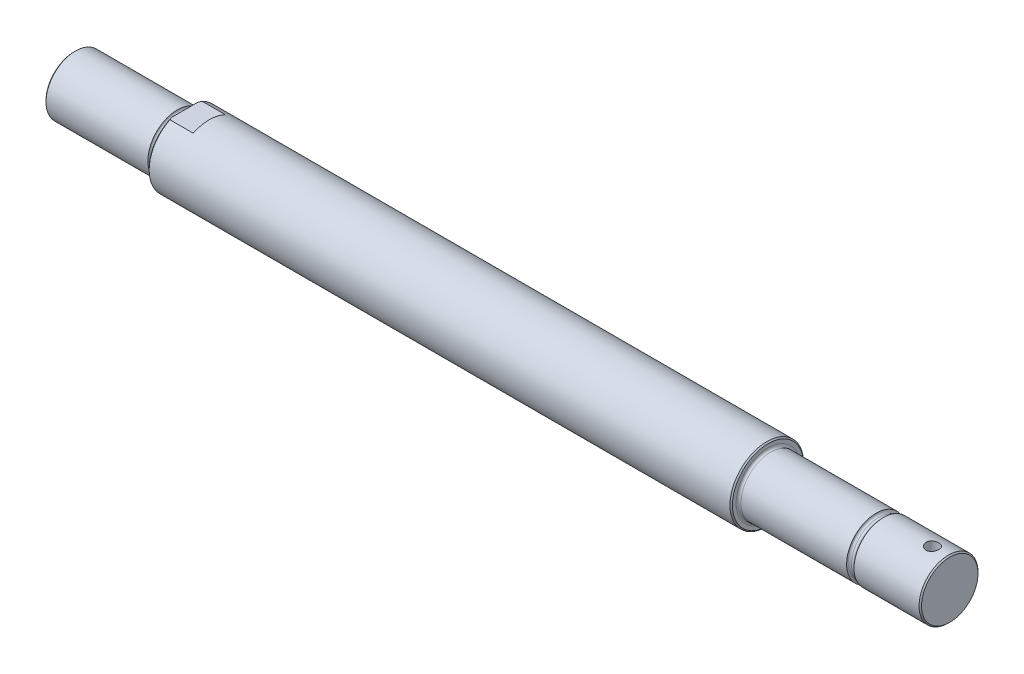
ISO-10303-21;
HEADER;
FILE_DESCRIPTION(('STEP AP214'),'2;1');
FILE_NAME('part.step','',(''),(''),'','','');
FILE_SCHEMA(('AUTOMOTIVE_DESIGN { 1 0 10303 214 1 1 1 1 }'));
ENDSEC;
DATA;
#1=APPLICATION_CONTEXT('core data for automotive mechanical design processes');
#2=APPLICATION_PROTOCOL_DEFINITION('international standard','automotive_design',2000,#1);
#3=PRODUCT_CONTEXT('',#1,'mechanical');
#4=PRODUCT('Part','Part','',(#3));
#5=PRODUCT_RELATED_PRODUCT_CATEGORY('part','',(#4));
#6=PRODUCT_DEFINITION_FORMATION('','',#4);
#7=PRODUCT_DEFINITION_CONTEXT('part definition',#1,'design');
#8=PRODUCT_DEFINITION('design','',#6,#7);
#9=PRODUCT_DEFINITION_SHAPE('','',#8);
#10=(LENGTH_UNIT() NAMED_UNIT(*) SI_UNIT(.MILLI.,.METRE.));
#11=(NAMED_UNIT(*) PLANE_ANGLE_UNIT() SI_UNIT($,.RADIAN.));
#12=(NAMED_UNIT(*) SI_UNIT($,.STERADIAN.) SOLID_ANGLE_UNIT());
#13=UNCERTAINTY_MEASURE_WITH_UNIT(LENGTH_MEASURE(1.E-05),#10,'distance_accuracy_value','');
#14=(GEOMETRIC_REPRESENTATION_CONTEXT(3) GLOBAL_UNCERTAINTY_ASSIGNED_CONTEXT((#13)) GLOBAL_UNIT_ASSIGNED_CONTEXT((#10,
#11,#12)) REPRESENTATION_CONTEXT('',''));
#15=CARTESIAN_POINT('',(0.,0.,0.));
#16=DIRECTION('',(0.,0.,1.));
#17=DIRECTION('',(1.,0.,0.));
#18=AXIS2_PLACEMENT_3D('',#15,#16,#17);
#19=CARTESIAN_POINT('',(-178.25,0.,0.));
#20=DIRECTION('',(-1.,0.,0.));
#21=DIRECTION('',(0.,0.,1.));
#22=AXIS2_PLACEMENT_3D('',#19,#20,#21);
#23=CYLINDRICAL_SURFACE('',#22,15.);
#24=CARTESIAN_POINT('',(103.75,0.,0.));
#25=DIRECTION('',(-1.,0.,0.));
#26=DIRECTION('',(0.,0.,1.));
#27=AXIS2_PLACEMENT_3D('',#24,#25,#26);
#28=CIRCLE('',#27,15.);
#29=CARTESIAN_POINT('',(103.75,0.,15.));
#30=VERTEX_POINT('',#29);
#31=EDGE_CURVE('E200',#30,#30,#28,.T.);
#32=ORIENTED_EDGE('',*,*,#31,.T.);
#33=EDGE_LOOP('',(#32));
#34=FACE_BOUND('',#33,.T.);
#35=DIRECTION('',(-1.,0.,0.));
#36=VECTOR('',#35,1.);
#37=CARTESIAN_POINT('',(-178.25,13.5,6.538348415311));
#38=LINE('',#37,#36);
#39=CARTESIAN_POINT('',(-123.25,13.5,6.538348415311));
#40=VERTEX_POINT('',#39);
#41=CARTESIAN_POINT('',(-132.75,13.5,6.538348415311));
#42=VERTEX_POINT('',#41);
#43=EDGE_CURVE('E358',#40,#42,#38,.T.);
#44=ORIENTED_EDGE('',*,*,#43,.T.);
#45=CARTESIAN_POINT('',(-132.75,0.,0.));
#46=DIRECTION('',(-1.,0.,0.));
#47=DIRECTION('',(0.,0.,1.));
#48=AXIS2_PLACEMENT_3D('',#45,#46,#47);
#49=CIRCLE('',#48,15.);
#50=CARTESIAN_POINT('',(-132.75,-13.5,6.53834841531101));
#51=VERTEX_POINT('',#50);
#52=EDGE_CURVE('E197',#42,#51,#49,.F.);
#53=ORIENTED_EDGE('',*,*,#52,.T.);
#54=DIRECTION('',(-1.,0.,0.));
#55=VECTOR('',#54,1.);
#56=CARTESIAN_POINT('',(-178.25,-13.5,6.53834841531101));
#57=LINE('',#56,#55);
#58=CARTESIAN_POINT('',(-123.25,-13.5,6.53834841531101));
#59=VERTEX_POINT('',#58);
#60=EDGE_CURVE('E139',#59,#51,#57,.T.);
#61=ORIENTED_EDGE('',*,*,#60,.F.);
#62=CARTESIAN_POINT('',(-123.25,0.,0.));
#63=DIRECTION('',(1.,0.,0.));
#64=DIRECTION('',(0.,0.,-1.));
#65=AXIS2_PLACEMENT_3D('',#62,#63,#64);
#66=CIRCLE('',#65,15.);
#67=CARTESIAN_POINT('',(-123.25,-13.5,-6.538348415311));
#68=VERTEX_POINT('',#67);
#69=EDGE_CURVE('E144',#59,#68,#66,.T.);
#70=ORIENTED_EDGE('',*,*,#69,.T.);
#71=DIRECTION('',(-1.,0.,0.));
#72=VECTOR('',#71,1.);
#73=CARTESIAN_POINT('',(-178.25,-13.5,-6.53834841531101));
#74=LINE('',#73,#72);
#75=CARTESIAN_POINT('',(-132.75,-13.5,-6.53834841531101));
#76=VERTEX_POINT('',#75);
#77=EDGE_CURVE('E125',#76,#68,#74,.F.);
#78=ORIENTED_EDGE('',*,*,#77,.F.);
#79=CARTESIAN_POINT('',(-132.75,0.,0.));
#80=DIRECTION('',(-1.,0.,0.));
#81=DIRECTION('',(0.,0.,1.));
#82=AXIS2_PLACEMENT_3D('',#79,#80,#81);
#83=CIRCLE('',#82,15.);
#84=CARTESIAN_POINT('',(-132.75,13.5,-6.53834841531101));
#85=VERTEX_POINT('',#84);
#86=EDGE_CURVE('E194',#76,#85,#83,.F.);
#87=ORIENTED_EDGE('',*,*,#86,.T.);
#88=DIRECTION('',(-1.,0.,0.));
#89=VECTOR('',#88,1.);
#90=CARTESIAN_POINT('',(-178.25,13.5,-6.53834841531101));
#91=LINE('',#90,#89);
#92=CARTESIAN_POINT('',(-123.25,13.5,-6.53834841531101));
#93=VERTEX_POINT('',#92);
#94=EDGE_CURVE('E411',#85,#93,#91,.F.);
#95=ORIENTED_EDGE('',*,*,#94,.T.);
#96=CARTESIAN_POINT('',(-123.25,0.,0.));
#97=DIRECTION('',(-1.,0.,0.));
#98=DIRECTION('',(0.,0.,1.));
#99=AXIS2_PLACEMENT_3D('',#96,#97,#98);
#100=CIRCLE('',#99,15.);
#101=EDGE_CURVE('E150',#40,#93,#100,.T.);
#102=ORIENTED_EDGE('',*,*,#101,.F.);
#103=EDGE_LOOP('',(#44,#53,#61,#70,#78,#87,#95,#102));
#104=FACE_BOUND('',#103,.T.);
#105=ADVANCED_FACE('F69',(#34,#104),#23,.T.);
#106=CARTESIAN_POINT('',(-133.25,15.,0.));
#107=DIRECTION('',(-1.,0.,0.));
#108=DIRECTION('',(0.,-1.,0.));
#109=AXIS2_PLACEMENT_3D('',#106,#107,#108);
#110=PLANE('',#109);
#111=CARTESIAN_POINT('',(-133.25,0.,0.));
#112=DIRECTION('',(-1.,0.,0.));
#113=DIRECTION('',(0.,-1.,0.));
#114=AXIS2_PLACEMENT_3D('',#111,#112,#113);
#115=CIRCLE('',#114,12.);
#116=CARTESIAN_POINT('',(-133.25,-12.,0.));
#117=VERTEX_POINT('',#116);
#118=EDGE_CURVE('E186',#117,#117,#115,.F.);
#119=ORIENTED_EDGE('',*,*,#118,.T.);
#120=EDGE_LOOP('',(#119));
#121=FACE_BOUND('',#120,.T.);
#122=DIRECTION('',(0.,0.,1.));
#123=VECTOR('',#122,1.);
#124=CARTESIAN_POINT('',(-133.25,-13.5,0.));
#125=LINE('',#124,#123);
#126=CARTESIAN_POINT('',(-133.25,-13.5,-5.29150262212928));
#127=VERTEX_POINT('',#126);
#128=CARTESIAN_POINT('',(-133.25,-13.5,5.29150262212928));
#129=VERTEX_POINT('',#128);
#130=EDGE_CURVE('E159',#127,#129,#125,.T.);
#131=ORIENTED_EDGE('',*,*,#130,.T.);
#132=CARTESIAN_POINT('',(-133.25,0.,0.));
#133=DIRECTION('',(-1.,0.,0.));
#134=DIRECTION('',(0.,-1.,0.));
#135=AXIS2_PLACEMENT_3D('',#132,#133,#134);
#136=CIRCLE('',#135,14.5);
#137=CARTESIAN_POINT('',(-133.25,13.5,5.29150262212928));
#138=VERTEX_POINT('',#137);
#139=EDGE_CURVE('E86',#129,#138,#136,.T.);
#140=ORIENTED_EDGE('',*,*,#139,.T.);
#141=DIRECTION('',(0.,0.,1.));
#142=VECTOR('',#141,1.);
#143=CARTESIAN_POINT('',(-133.25,13.5,0.));
#144=LINE('',#143,#142);
#145=CARTESIAN_POINT('',(-133.25,13.5,-5.29150262212928));
#146=VERTEX_POINT('',#145);
#147=EDGE_CURVE('E151',#146,#138,#144,.T.);
#148=ORIENTED_EDGE('',*,*,#147,.F.);
#149=CARTESIAN_POINT('',(-133.25,0.,0.));
#150=DIRECTION('',(-1.,0.,0.));
#151=DIRECTION('',(0.,-1.,0.));
#152=AXIS2_PLACEMENT_3D('',#149,#150,#151);
#153=CIRCLE('',#152,14.5);
#154=EDGE_CURVE('E400',#146,#127,#153,.T.);
#155=ORIENTED_EDGE('',*,*,#154,.T.);
#156=EDGE_LOOP('',(#131,#140,#148,#155));
#157=FACE_BOUND('',#156,.T.);
#158=ADVANCED_FACE('F268',(#121,#157),#110,.T.);
#159=CARTESIAN_POINT('',(178.25,0.,0.));
#160=DIRECTION('',(1.,0.,0.));
#161=DIRECTION('',(0.,1.,0.));
#162=AXIS2_PLACEMENT_3D('',#159,#160,#161);
#163=CYLINDRICAL_SURFACE('',#162,12.);
#164=CARTESIAN_POINT('',(177.75,0.,0.));
#165=DIRECTION('',(-1.,0.,0.));
#166=DIRECTION('',(0.,-1.,0.));
#167=AXIS2_PLACEMENT_3D('',#164,#165,#166);
#168=CIRCLE('',#167,12.);
#169=CARTESIAN_POINT('',(177.75,-12.,0.));
#170=VERTEX_POINT('',#169);
#171=EDGE_CURVE('E208',#170,#170,#168,.T.);
#172=ORIENTED_EDGE('',*,*,#171,.T.);
#173=EDGE_LOOP('',(#172));
#174=FACE_BOUND('',#173,.T.);
#175=CARTESIAN_POINT('',(168.65,12.,0.));
#176=CARTESIAN_POINT('',(168.650004972303,11.9999973354446,0.144236726439558));
#177=CARTESIAN_POINT('',(168.662042967354,11.9973730147826,0.288533845639436));
#178=CARTESIAN_POINT('',(168.709828238634,11.9871575196756,0.573031652658619));
#179=CARTESIAN_POINT('',(168.745592673061,11.9795627508158,0.713229299208327));
#180=CARTESIAN_POINT('',(168.839659865051,11.9602522565868,0.985375249675089));
#181=CARTESIAN_POINT('',(168.897939301033,11.9485407965133,1.11733192602805));
#182=CARTESIAN_POINT('',(169.035308673135,11.9222619563313,1.36958904863448));
#183=CARTESIAN_POINT('',(169.114397991646,11.9076946609835,1.48988984067429));
#184=CARTESIAN_POINT('',(169.292461597268,11.8770440902161,1.71732166523923));
#185=CARTESIAN_POINT('',(169.391700998679,11.8609423068128,1.82424265549683));
#186=CARTESIAN_POINT('',(169.606678488386,11.8291684195956,2.02005881340805));
#187=CARTESIAN_POINT('',(169.722418024412,11.8134963536293,2.1089523976706));
#188=CARTESIAN_POINT('',(169.968658566674,11.7841740733055,2.26711337737444));
#189=CARTESIAN_POINT('',(170.099305825496,11.7705475862121,2.33615786385217));
#190=CARTESIAN_POINT('',(170.37069243936,11.7471246428021,2.45123108596793));
#191=CARTESIAN_POINT('',(170.51143060977,11.7373277377766,2.49726251820138));
#192=CARTESIAN_POINT('',(170.796727639718,11.7228615532269,2.56431019661689));
#193=CARTESIAN_POINT('',(170.941195252538,11.7181162066326,2.58569794861031));
#194=CARTESIAN_POINT('',(171.231740095497,11.714061911669,2.60400615804867));
#195=CARTESIAN_POINT('',(171.377817129506,11.71475230804,2.60092956458315));
#196=CARTESIAN_POINT('',(171.664677398804,11.7214225988847,2.57069554242108));
#197=CARTESIAN_POINT('',(171.805508585277,11.7273078350462,2.54396903156786));
#198=CARTESIAN_POINT('',(172.080639595153,11.7435550978599,2.46787625956814));
#199=CARTESIAN_POINT('',(172.214939057839,11.7539173714466,2.41850874963034));
#200=CARTESIAN_POINT('',(172.474409227574,11.7780448194994,2.29813787328689));
#201=CARTESIAN_POINT('',(172.599500280537,11.7918359866955,2.22696823220314));
#202=CARTESIAN_POINT('',(172.836124048607,11.8212512787303,2.065130298781));
#203=CARTESIAN_POINT('',(172.947654945252,11.8368756488568,1.9744593957635));
#204=CARTESIAN_POINT('',(173.156474019979,11.8686034657252,1.77390871521164));
#205=CARTESIAN_POINT('',(173.253409997498,11.8847100454316,1.66366235662348));
#206=CARTESIAN_POINT('',(173.427473894395,11.9152855453676,1.42829655036696));
#207=CARTESIAN_POINT('',(173.504601467898,11.9297544369988,1.30317684305031));
#208=CARTESIAN_POINT('',(173.636943705019,11.9554698973281,1.04119055177431));
#209=CARTESIAN_POINT('',(173.692112890846,11.9667097651791,0.904300295205736));
#210=CARTESIAN_POINT('',(173.77856861265,11.9846508353724,0.622894974848423));
#211=CARTESIAN_POINT('',(173.80985855501,11.9913526850491,0.478381001731169));
#212=CARTESIAN_POINT('',(173.847156868924,11.999370689196,0.188852168823128));
#213=CARTESIAN_POINT('',(173.853646449489,12.0007893411299,0.0439020574477344));
#214=CARTESIAN_POINT('',(173.842463167102,11.9983680429883,-0.245011114222885));
#215=CARTESIAN_POINT('',(173.824791910674,11.9945284425491,-0.388974239506001));
#216=CARTESIAN_POINT('',(173.766187693156,11.9820866849589,-0.670237247334904));
#217=CARTESIAN_POINT('',(173.725506502814,11.9735361004107,-0.80759207245683));
#218=CARTESIAN_POINT('',(173.622316167325,11.9526291720799,-1.0735286997633));
#219=CARTESIAN_POINT('',(173.559805186749,11.9402725082958,-1.20210976317082));
#220=CARTESIAN_POINT('',(173.413722739961,11.9128709234998,-1.44884325605772));
#221=CARTESIAN_POINT('',(173.329867778462,11.8977906795577,-1.56682382807616));
#222=CARTESIAN_POINT('',(173.143851729171,11.8666879962894,-1.78721154382001));
#223=CARTESIAN_POINT('',(173.041688311542,11.8506654372236,-1.88961670243109));
#224=CARTESIAN_POINT('',(172.819749150625,11.8191309043505,-2.07784405093427));
#225=CARTESIAN_POINT('',(172.699688642265,11.8036333783503,-2.16333333925308));
#226=CARTESIAN_POINT('',(172.446631314418,11.775234476741,-2.31293638979139));
#227=CARTESIAN_POINT('',(172.313635051273,11.7623329895541,-2.37705107076864));
#228=CARTESIAN_POINT('',(172.039191143534,11.7407086018304,-2.48165614660999));
#229=CARTESIAN_POINT('',(171.897795682338,11.7319624281802,-2.52227840324693));
#230=CARTESIAN_POINT('',(171.609972351161,11.7195960803086,-2.57913351826821));
#231=CARTESIAN_POINT('',(171.463545272258,11.7159751040391,-2.59537019280476));
#232=CARTESIAN_POINT('',(171.173170103694,11.7143189953347,-2.60283320848537));
#233=CARTESIAN_POINT('',(171.029235994595,11.7161660225572,-2.59458716285149));
#234=CARTESIAN_POINT('',(170.744860265962,11.7249716694698,-2.55449661594729));
#235=CARTESIAN_POINT('',(170.60441860688,11.7319302312494,-2.52265238202999));
#236=CARTESIAN_POINT('',(170.331424000623,11.7501179820486,-2.43652213110984));
#237=CARTESIAN_POINT('',(170.198846241061,11.7613328104136,-2.38231152530464));
#238=CARTESIAN_POINT('',(169.944588721284,11.786775368259,-2.25305267013939));
#239=CARTESIAN_POINT('',(169.822910073498,11.8010034047887,-2.1780022969411));
#240=CARTESIAN_POINT('',(169.591300835105,11.8312222292587,-2.00743837935343));
#241=CARTESIAN_POINT('',(169.481651360132,11.8472423996664,-1.91154824147323));
#242=CARTESIAN_POINT('',(169.279826560398,11.8790414924123,-1.70279162388224));
#243=CARTESIAN_POINT('',(169.187655276868,11.8948203581836,-1.58992122886305));
#244=CARTESIAN_POINT('',(169.022286252632,11.9245960952928,-1.34868418142398));
#245=CARTESIAN_POINT('',(168.949343857588,11.9385678399551,-1.22013921864495));
#246=CARTESIAN_POINT('',(168.826215648375,11.9629036221577,-0.952339105556218));
#247=CARTESIAN_POINT('',(168.776010585299,11.9732707095849,-0.813093131747957));
#248=CARTESIAN_POINT('',(168.70881884729,11.9873604762337,-0.561406270703277));
#249=CARTESIAN_POINT('',(168.686803544831,11.9920711259945,-0.450335585529253));
#250=CARTESIAN_POINT('',(168.657392484021,11.9983918663936,-0.226188923413988));
#251=CARTESIAN_POINT('',(168.64999610063,12.0000020895922,-0.11311303241497));
#252=CARTESIAN_POINT('',(168.65,12.,0.));
#253=B_SPLINE_CURVE_WITH_KNOTS('',3,(#175,#176,#177,#178,#179,#180,#181,#182,#183,#184,#185,
#186,#187,#188,#189,#190,#191,#192,#193,#194,#195,#196,#197,#198,#199,#200,#201,#202,#203,#204,
#205,#206,#207,#208,#209,#210,#211,#212,#213,#214,#215,#216,#217,#218,#219,#220,#221,#222,#223,
#224,#225,#226,#227,#228,#229,#230,#231,#232,#233,#234,#235,#236,#237,#238,#239,#240,#241,#242,
#243,#244,#245,#246,#247,#248,#249,#250,#251,#252),.UNSPECIFIED.,.T.,.F.,(4,2,2,2,2,2,2,2,2,2,2,
2,2,2,2,2,2,2,2,2,2,2,2,2,2,2,2,2,2,2,2,2,2,2,2,2,2,2,4),(0.,0.432296167596458,
0.864905299162181,1.29706752004108,1.72921691636087,2.16747088004792,2.60576331999454,
3.04880106599835,3.49178688609446,3.92800348668547,4.36416750371916,4.7925442862594,
5.22094469927376,5.65269728196235,6.08450770038595,6.52547542392672,6.96645084669751,
7.40833487520641,7.85015585701494,8.28335919264328,8.71653372472676,9.14505776341681,
9.57361784070126,10.0081977504593,10.4428330018757,10.885318030012,11.3277840360924,
11.767741776118,12.2076306590336,12.6381090344705,13.0685825329256,13.4976163421279,
13.9266938914079,14.364287920262,14.8019830046558,15.2452268636413,15.6880947778048,
16.0271236952943,16.366138117108),.UNSPECIFIED.);
#254=CARTESIAN_POINT('',(168.65,12.,0.));
#255=VERTEX_POINT('',#254);
#256=EDGE_CURVE('E337',#255,#255,#253,.T.);
#257=ORIENTED_EDGE('',*,*,#256,.F.);
#258=EDGE_LOOP('',(#257));
#259=FACE_BOUND('',#258,.T.);
#260=CARTESIAN_POINT('',(171.25,-11.714947716486,2.59999999999999));
#261=CARTESIAN_POINT('',(171.105808071027,-11.7149506300318,2.59999499534854));
#262=CARTESIAN_POINT('',(170.961555668416,-11.7176388577269,2.58796422285042));
#263=CARTESIAN_POINT('',(170.677150686029,-11.7280820029083,2.54021023721584));
#264=CARTESIAN_POINT('',(170.537001184745,-11.7358406279201,2.50446968696193));
#265=CARTESIAN_POINT('',(170.264957242693,-11.7555055486852,2.41047231141574));
#266=CARTESIAN_POINT('',(170.133054021162,-11.7674073408381,2.35223992712881));
#267=CARTESIAN_POINT('',(169.880887156447,-11.7940121510493,2.21498149637594));
#268=CARTESIAN_POINT('',(169.760623227204,-11.8087151002375,2.13595596111855));
#269=CARTESIAN_POINT('',(169.53315267133,-11.8395378925012,1.9579579997251));
#270=CARTESIAN_POINT('',(169.426167097344,-11.8556755712714,1.85870612184275));
#271=CARTESIAN_POINT('',(169.230225467065,-11.8873932725662,1.6436761932946));
#272=CARTESIAN_POINT('',(169.14127079599,-11.90297325217,1.52789687407801));
#273=CARTESIAN_POINT('',(168.983043558656,-11.9320141366661,1.28161861627876));
#274=CARTESIAN_POINT('',(168.91398331399,-11.9454515442086,1.15098025766275));
#275=CARTESIAN_POINT('',(168.798878539532,-11.9684919123295,0.879612849767239));
#276=CARTESIAN_POINT('',(168.75283147631,-11.978095294957,0.738884913160424));
#277=CARTESIAN_POINT('',(168.685754606161,-11.9922595380826,0.453631049271671));
#278=CARTESIAN_POINT('',(168.664350773055,-11.9968957117097,0.309196876165756));
#279=CARTESIAN_POINT('',(168.645998797252,-12.0008640083932,0.0187183852466908));
#280=CARTESIAN_POINT('',(168.649047907106,-12.0001967273276,-0.127325749835409));
#281=CARTESIAN_POINT('',(168.679236113251,-11.9936909484855,-0.414301026380135));
#282=CARTESIAN_POINT('',(168.705972087125,-11.9879389895303,-0.555276824288543));
#283=CARTESIAN_POINT('',(168.782133037528,-11.972008636555,-0.830692063804933));
#284=CARTESIAN_POINT('',(168.83155902721,-11.9618300448781,-0.965131213242441));
#285=CARTESIAN_POINT('',(168.952055481834,-11.9380505435059,-1.2247795133764));
#286=CARTESIAN_POINT('',(169.023279335575,-11.924425503437,-1.34991517963827));
#287=CARTESIAN_POINT('',(169.185235455801,-11.8952479893853,-1.58660567091395));
#288=CARTESIAN_POINT('',(169.275970333295,-11.8796952575525,-1.69815867513289));
#289=CARTESIAN_POINT('',(169.476569499688,-11.8479985747636,-1.9069142433668));
#290=CARTESIAN_POINT('',(169.586786607313,-11.831849036322,-2.00377721909878));
#291=CARTESIAN_POINT('',(169.822066863526,-11.8010768696216,-2.17770734206603));
#292=CARTESIAN_POINT('',(169.947130399308,-11.7864542812042,-2.25477397284819));
#293=CARTESIAN_POINT('',(170.209095441474,-11.7603772959716,-2.38707079423465));
#294=CARTESIAN_POINT('',(170.3460298026,-11.7489320859654,-2.44223785994898));
#295=CARTESIAN_POINT('',(170.6275318274,-11.7306337989501,-2.52867613095888));
#296=CARTESIAN_POINT('',(170.77209830153,-11.7237800085877,-2.55995104840175));
#297=CARTESIAN_POINT('',(171.06166074473,-11.7155857757038,-2.59719269835716));
#298=CARTESIAN_POINT('',(171.206590207231,-11.714137731798,-2.60365343331652));
#299=CARTESIAN_POINT('',(171.49545541092,-11.7166288478047,-2.59241985028292));
#300=CARTESIAN_POINT('',(171.639391218338,-11.7205676451107,-2.57472715813842));
#301=CARTESIAN_POINT('',(171.92047001659,-11.733287126794,-2.51611725451018));
#302=CARTESIAN_POINT('',(172.057672344591,-11.7420112458403,-2.47547120265603));
#303=CARTESIAN_POINT('',(172.32331934446,-11.7632675177894,-2.37240155419931));
#304=CARTESIAN_POINT('',(172.451763189693,-11.7758000295249,-2.30997590540734));
#305=CARTESIAN_POINT('',(172.698387696241,-11.8034980027526,-2.16402732754586));
#306=CARTESIAN_POINT('',(172.816383709872,-11.818700425937,-2.08019953748662));
#307=CARTESIAN_POINT('',(173.036815015652,-11.8499273689652,-1.89422599437251));
#308=CARTESIAN_POINT('',(173.139248410603,-11.8659519887228,-1.79207801125626));
#309=CARTESIAN_POINT('',(173.327559160709,-11.8973718264988,-1.57013026191641));
#310=CARTESIAN_POINT('',(173.413100033166,-11.9127502076758,-1.45004222260283));
#311=CARTESIAN_POINT('',(173.562793541039,-11.940837013015,-1.19691389957492));
#312=CARTESIAN_POINT('',(173.626947165099,-11.9535455605824,-1.06387421492847));
#313=CARTESIAN_POINT('',(173.731573988276,-11.974789690183,-0.789439876043639));
#314=CARTESIAN_POINT('',(173.77219556423,-11.9833513621378,-0.648103900948666));
#315=CARTESIAN_POINT('',(173.829069385307,-11.995449777427,-0.36040783253454));
#316=CARTESIAN_POINT('',(173.845325103092,-11.998987236817,-0.21404845820063));
#317=CARTESIAN_POINT('',(173.852852086312,-12.0006178834246,0.0763433045858421));
#318=CARTESIAN_POINT('',(173.844626123566,-11.9988206298237,0.220362276509854));
#319=CARTESIAN_POINT('',(173.804546194341,-11.9902180245313,0.504913147396077));
#320=CARTESIAN_POINT('',(173.772692637191,-11.9834127595998,0.645445106724525));
#321=CARTESIAN_POINT('',(173.68650073582,-11.9655663169557,0.918652480291165));
#322=CARTESIAN_POINT('',(173.632232467616,-11.9545383486205,1.05135091995898));
#323=CARTESIAN_POINT('',(173.502820428586,-11.9294252118726,1.30582634329755));
#324=CARTESIAN_POINT('',(173.427674672628,-11.9153397527671,1.42760228694812));
#325=CARTESIAN_POINT('',(173.25699491074,-11.8853211156753,1.65923226441778));
#326=CARTESIAN_POINT('',(173.161106630302,-11.8693583641116,1.76882143805988));
#327=CARTESIAN_POINT('',(172.952379890983,-11.8375453740579,1.97052545166515));
#328=CARTESIAN_POINT('',(172.839537361588,-11.8216951635473,2.06263608318612));
#329=CARTESIAN_POINT('',(172.598332728296,-11.7916713632252,2.22792599963228));
#330=CARTESIAN_POINT('',(172.469787123146,-11.7775223839328,2.30084222447144));
#331=CARTESIAN_POINT('',(172.20198849329,-11.7528114262808,2.42392133822827));
#332=CARTESIAN_POINT('',(172.062744724967,-11.7422463889105,2.4741036436211));
#333=CARTESIAN_POINT('',(171.81111539032,-11.7278707536719,2.54124250613354));
#334=CARTESIAN_POINT('',(171.700103257723,-11.7230565314123,2.56323463936517));
#335=CARTESIAN_POINT('',(171.476073079218,-11.716593944907,2.59261500559942));
#336=CARTESIAN_POINT('',(171.363055127697,-11.7149454320912,2.60000392394714));
#337=CARTESIAN_POINT('',(171.25,-11.714947716486,2.59999999999999));
#338=B_SPLINE_CURVE_WITH_KNOTS('',3,(#260,#261,#262,#263,#264,#265,#266,#267,#268,#269,#270,
#271,#272,#273,#274,#275,#276,#277,#278,#279,#280,#281,#282,#283,#284,#285,#286,#287,#288,#289,
#290,#291,#292,#293,#294,#295,#296,#297,#298,#299,#300,#301,#302,#303,#304,#305,#306,#307,#308,
#309,#310,#311,#312,#313,#314,#315,#316,#317,#318,#319,#320,#321,#322,#323,#324,#325,#326,#327,
#328,#329,#330,#331,#332,#333,#334,#335,#336,#337),.UNSPECIFIED.,.T.,.F.,(4,2,2,2,2,2,2,2,2,2,2,
2,2,2,2,2,2,2,2,2,2,2,2,2,2,2,2,2,2,2,2,2,2,2,2,2,2,2,4),(0.,0.432161493823311,
0.864639342588248,1.29664855063133,1.72864713853472,2.16707728816394,2.60554110726698,
3.04852433811463,3.49145879195404,3.92757804331551,4.36364829451038,4.79243672630817,
5.22124430620132,5.65314157085297,6.08509666897972,6.52587314294714,6.9666611148584,
7.40871057726847,7.85069134402905,8.28382608870744,8.71693167906616,9.14502470737239,
9.57315808377848,10.0077679909162,10.4424308377473,10.8850309556059,11.3276106110721,
11.7673684074966,12.2070635229448,12.6377914980314,13.0685120112597,13.4978960173905,
13.9273208653775,14.3647586634598,14.8023016535098,15.2455611281641,15.6884413088886,
16.0272977646138,16.3661383170514),.UNSPECIFIED.);
#339=CARTESIAN_POINT('',(171.25,-11.714947716486,2.59999999999999));
#340=VERTEX_POINT('',#339);
#341=EDGE_CURVE('E341',#340,#340,#338,.T.);
#342=ORIENTED_EDGE('',*,*,#341,.F.);
#343=EDGE_LOOP('',(#342));
#344=FACE_BOUND('',#343,.T.);
#345=CARTESIAN_POINT('',(151.25,0.,0.));
#346=DIRECTION('',(-1.,0.,0.));
#347=DIRECTION('',(0.,-1.,0.));
#348=AXIS2_PLACEMENT_3D('',#345,#346,#347);
#349=CIRCLE('',#348,12.);
#350=CARTESIAN_POINT('',(151.25,-12.,0.));
#351=VERTEX_POINT('',#350);
#352=EDGE_CURVE('E344',#351,#351,#349,.F.);
#353=ORIENTED_EDGE('',*,*,#352,.T.);
#354=EDGE_LOOP('',(#353));
#355=FACE_BOUND('',#354,.T.);
#356=ADVANCED_FACE('F274',(#174,#259,#344,#355),#163,.T.);
#357=CARTESIAN_POINT('',(105.25,0.,0.));
#358=DIRECTION('',(-1.,0.,0.));
#359=DIRECTION('',(0.,-1.,0.));
#360=AXIS2_PLACEMENT_3D('',#357,#358,#359);
#361=CIRCLE('',#360,12.);
#362=CARTESIAN_POINT('',(105.25,-12.,0.));
#363=VERTEX_POINT('',#362);
#364=EDGE_CURVE('E170',#363,#363,#361,.F.);
#365=ORIENTED_EDGE('',*,*,#364,.T.);
#366=EDGE_LOOP('',(#365));
#367=FACE_BOUND('',#366,.T.);
#368=CARTESIAN_POINT('',(148.25,0.,0.));
#369=DIRECTION('',(-1.,0.,0.));
#370=DIRECTION('',(0.,-1.,0.));
#371=AXIS2_PLACEMENT_3D('',#368,#369,#370);
#372=CIRCLE('',#371,12.);
#373=CARTESIAN_POINT('',(148.25,-12.,0.));
#374=VERTEX_POINT('',#373);
#375=EDGE_CURVE('E347',#374,#374,#372,.F.);
#376=ORIENTED_EDGE('',*,*,#375,.F.);
#377=EDGE_LOOP('',(#376));
#378=FACE_BOUND('',#377,.T.);
#379=ADVANCED_FACE('F332',(#367,#378),#163,.T.);
#380=CARTESIAN_POINT('',(104.25,15.,0.));
#381=DIRECTION('',(-1.,0.,0.));
#382=DIRECTION('',(0.,-1.,0.));
#383=AXIS2_PLACEMENT_3D('',#380,#381,#382);
#384=PLANE('',#383);
#385=CARTESIAN_POINT('',(104.25,0.,0.));
#386=DIRECTION('',(-1.,0.,0.));
#387=DIRECTION('',(0.,-1.,0.));
#388=AXIS2_PLACEMENT_3D('',#385,#386,#387);
#389=CIRCLE('',#388,14.5000000000001);
#390=CARTESIAN_POINT('',(104.25,-14.5,0.));
#391=VERTEX_POINT('',#390);
#392=EDGE_CURVE('E190',#391,#391,#389,.F.);
#393=ORIENTED_EDGE('',*,*,#392,.T.);
#394=EDGE_LOOP('',(#393));
#395=FACE_BOUND('',#394,.T.);
#396=CARTESIAN_POINT('',(104.25,0.,0.));
#397=DIRECTION('',(-1.,0.,0.));
#398=DIRECTION('',(0.,-1.,0.));
#399=AXIS2_PLACEMENT_3D('',#396,#397,#398);
#400=CIRCLE('',#399,13.);
#401=CARTESIAN_POINT('',(104.25,-13.,0.));
#402=VERTEX_POINT('',#401);
#403=EDGE_CURVE('E174',#402,#402,#400,.T.);
#404=ORIENTED_EDGE('',*,*,#403,.T.);
#405=EDGE_LOOP('',(#404));
#406=FACE_BOUND('',#405,.T.);
#407=ADVANCED_FACE('F376',(#395,#406),#384,.F.);
#408=CARTESIAN_POINT('',(178.25,0.,0.));
#409=DIRECTION('',(1.,0.,0.));
#410=DIRECTION('',(0.,1.,0.));
#411=AXIS2_PLACEMENT_3D('',#408,#409,#410);
#412=CYLINDRICAL_SURFACE('',#411,11.);
#413=CARTESIAN_POINT('',(150.25,0.,0.));
#414=DIRECTION('',(-1.,0.,0.));
#415=DIRECTION('',(0.,-1.,0.));
#416=AXIS2_PLACEMENT_3D('',#413,#414,#415);
#417=CIRCLE('',#416,11.);
#418=CARTESIAN_POINT('',(150.25,-11.,0.));
#419=VERTEX_POINT('',#418);
#420=EDGE_CURVE('E166',#419,#419,#417,.T.);
#421=ORIENTED_EDGE('',*,*,#420,.T.);
#422=EDGE_LOOP('',(#421));
#423=FACE_BOUND('',#422,.T.);
#424=CARTESIAN_POINT('',(149.25,0.,0.));
#425=DIRECTION('',(-1.,0.,0.));
#426=DIRECTION('',(0.,-1.,0.));
#427=AXIS2_PLACEMENT_3D('',#424,#425,#426);
#428=CIRCLE('',#427,11.);
#429=CARTESIAN_POINT('',(149.25,-11.,0.));
#430=VERTEX_POINT('',#429);
#431=EDGE_CURVE('E157',#430,#430,#428,.F.);
#432=ORIENTED_EDGE('',*,*,#431,.T.);
#433=EDGE_LOOP('',(#432));
#434=FACE_BOUND('',#433,.T.);
#435=ADVANCED_FACE('F277',(#423,#434),#412,.T.);
#436=CARTESIAN_POINT('',(178.25,0.,0.));
#437=DIRECTION('',(1.,0.,0.));
#438=DIRECTION('',(0.,1.,0.));
#439=AXIS2_PLACEMENT_3D('',#436,#437,#438);
#440=CYLINDRICAL_SURFACE('',#439,12.);
#441=CARTESIAN_POINT('',(-177.75,0.,0.));
#442=DIRECTION('',(1.,0.,0.));
#443=DIRECTION('',(0.,1.,0.));
#444=AXIS2_PLACEMENT_3D('',#441,#442,#443);
#445=CIRCLE('',#444,12.);
#446=CARTESIAN_POINT('',(-177.75,12.,0.));
#447=VERTEX_POINT('',#446);
#448=EDGE_CURVE('E79',#447,#447,#445,.T.);
#449=ORIENTED_EDGE('',*,*,#448,.T.);
#450=EDGE_LOOP('',(#449));
#451=FACE_BOUND('',#450,.T.);
#452=CARTESIAN_POINT('',(-136.25,0.,0.));
#453=DIRECTION('',(-1.,0.,0.));
#454=DIRECTION('',(0.,-1.,0.));
#455=AXIS2_PLACEMENT_3D('',#452,#453,#454);
#456=CIRCLE('',#455,12.);
#457=CARTESIAN_POINT('',(-136.25,-12.,0.));
#458=VERTEX_POINT('',#457);
#459=EDGE_CURVE('E348',#458,#458,#456,.T.);
#460=ORIENTED_EDGE('',*,*,#459,.T.);
#461=EDGE_LOOP('',(#460));
#462=FACE_BOUND('',#461,.T.);
#463=ADVANCED_FACE('F286',(#451,#462),#440,.T.);
#464=CARTESIAN_POINT('',(178.25,0.,0.));
#465=DIRECTION('',(1.,0.,0.));
#466=DIRECTION('',(0.,1.,0.));
#467=AXIS2_PLACEMENT_3D('',#464,#465,#466);
#468=CYLINDRICAL_SURFACE('',#467,11.);
#469=CARTESIAN_POINT('',(-135.25,0.,0.));
#470=DIRECTION('',(-1.,0.,0.));
#471=DIRECTION('',(0.,-1.,0.));
#472=AXIS2_PLACEMENT_3D('',#469,#470,#471);
#473=CIRCLE('',#472,11.);
#474=CARTESIAN_POINT('',(-135.25,-11.,0.));
#475=VERTEX_POINT('',#474);
#476=EDGE_CURVE('E182',#475,#475,#473,.F.);
#477=ORIENTED_EDGE('',*,*,#476,.T.);
#478=EDGE_LOOP('',(#477));
#479=FACE_BOUND('',#478,.T.);
#480=CARTESIAN_POINT('',(-134.25,0.,0.));
#481=DIRECTION('',(-1.,0.,0.));
#482=DIRECTION('',(0.,-1.,0.));
#483=AXIS2_PLACEMENT_3D('',#480,#481,#482);
#484=CIRCLE('',#483,11.);
#485=CARTESIAN_POINT('',(-134.25,-11.,0.));
#486=VERTEX_POINT('',#485);
#487=EDGE_CURVE('E178',#486,#486,#484,.T.);
#488=ORIENTED_EDGE('',*,*,#487,.T.);
#489=EDGE_LOOP('',(#488));
#490=FACE_BOUND('',#489,.T.);
#491=ADVANCED_FACE('F284',(#479,#490),#468,.T.);
#492=CARTESIAN_POINT('',(178.25,15.,0.));
#493=DIRECTION('',(-1.,0.,0.));
#494=DIRECTION('',(0.,0.,1.));
#495=AXIS2_PLACEMENT_3D('',#492,#493,#494);
#496=PLANE('',#495);
#497=CARTESIAN_POINT('',(178.25,0.,0.));
#498=DIRECTION('',(-1.,0.,0.));
#499=DIRECTION('',(0.,0.,1.));
#500=AXIS2_PLACEMENT_3D('',#497,#498,#499);
#501=CIRCLE('',#500,11.5);
#502=CARTESIAN_POINT('',(178.25,0.,11.5));
#503=VERTEX_POINT('',#502);
#504=EDGE_CURVE('E204',#503,#503,#501,.F.);
#505=ORIENTED_EDGE('',*,*,#504,.T.);
#506=EDGE_LOOP('',(#505));
#507=FACE_BOUND('',#506,.T.);
#508=ADVANCED_FACE('F280',(#507),#496,.F.);
#509=CARTESIAN_POINT('',(-178.25,15.,0.));
#510=DIRECTION('',(1.,0.,0.));
#511=DIRECTION('',(0.,0.,-1.));
#512=AXIS2_PLACEMENT_3D('',#509,#510,#511);
#513=PLANE('',#512);
#514=CARTESIAN_POINT('',(-178.25,0.,0.));
#515=DIRECTION('',(1.,0.,0.));
#516=DIRECTION('',(0.,0.,-1.));
#517=AXIS2_PLACEMENT_3D('',#514,#515,#516);
#518=CIRCLE('',#517,11.4999999999999);
#519=CARTESIAN_POINT('',(-178.25,0.,-11.4999999999999));
#520=VERTEX_POINT('',#519);
#521=EDGE_CURVE('E13',#520,#520,#518,.F.);
#522=ORIENTED_EDGE('',*,*,#521,.T.);
#523=EDGE_LOOP('',(#522));
#524=FACE_BOUND('',#523,.T.);
#525=ADVANCED_FACE('F283',(#524),#513,.F.);
#526=CARTESIAN_POINT('',(171.25,-15.,0.));
#527=DIRECTION('',(0.,0.999999999999999,0.));
#528=DIRECTION('',(0.,0.,1.));
#529=AXIS2_PLACEMENT_3D('',#526,#527,#528);
#530=CYLINDRICAL_SURFACE('',#529,2.59999999999999);
#531=ORIENTED_EDGE('',*,*,#256,.T.);
#532=EDGE_LOOP('',(#531));
#533=FACE_BOUND('',#532,.T.);
#534=ORIENTED_EDGE('',*,*,#341,.T.);
#535=EDGE_LOOP('',(#534));
#536=FACE_BOUND('',#535,.T.);
#537=ADVANCED_FACE('F289',(#533,#536),#530,.F.);
#538=CARTESIAN_POINT('',(-123.25,-15.,-15.));
#539=DIRECTION('',(1.,0.,0.));
#540=DIRECTION('',(0.,0.,-1.));
#541=AXIS2_PLACEMENT_3D('',#538,#539,#540);
#542=PLANE('',#541);
#543=DIRECTION('',(0.,0.,1.));
#544=VECTOR('',#543,1.);
#545=CARTESIAN_POINT('',(-123.25,-13.5,-15.));
#546=LINE('',#545,#544);
#547=EDGE_CURVE('E129',#68,#59,#546,.T.);
#548=ORIENTED_EDGE('',*,*,#547,.F.);
#549=ORIENTED_EDGE('',*,*,#69,.F.);
#550=EDGE_LOOP('',(#548,#549));
#551=FACE_BOUND('',#550,.T.);
#552=ADVANCED_FACE('F143',(#551),#542,.F.);
#553=CARTESIAN_POINT('',(-133.25,-13.5,-15.));
#554=DIRECTION('',(0.,-1.,0.));
#555=DIRECTION('',(0.,0.,-1.));
#556=AXIS2_PLACEMENT_3D('',#553,#554,#555);
#557=PLANE('',#556);
#558=ORIENTED_EDGE('',*,*,#60,.T.);
#559=CARTESIAN_POINT('',(-132.75,-13.5,6.53834841531101));
#560=CARTESIAN_POINT('',(-132.794743033035,-13.5,6.4357000597834));
#561=CARTESIAN_POINT('',(-132.838769882802,-13.5,6.33273833422771));
#562=CARTESIAN_POINT('',(-132.92530385203,-13.5,6.12620667940886));
#563=CARTESIAN_POINT('',(-132.967811323942,-13.5,6.02263689777205));
#564=CARTESIAN_POINT('',(-133.051240684097,-13.5,5.81485838225757));
#565=CARTESIAN_POINT('',(-133.092162551666,-13.5,5.71064964006873));
#566=CARTESIAN_POINT('',(-133.172348150164,-13.5,5.50156845042861));
#567=CARTESIAN_POINT('',(-133.211611491594,-13.5,5.39669585365019));
#568=CARTESIAN_POINT('',(-133.25,-13.5,5.29150262212927));
#569=B_SPLINE_CURVE_WITH_KNOTS('',3,(#559,#560,#561,#562,#563,#564,#565,#566,#567,#568),
.UNSPECIFIED.,.F.,.F.,(4,2,2,2,4),(0.,0.33592684318557,0.671775248950015,1.00762803250515,
1.34355925606217),.UNSPECIFIED.);
#570=EDGE_CURVE('E219',#51,#129,#569,.T.);
#571=ORIENTED_EDGE('',*,*,#570,.T.);
#572=ORIENTED_EDGE('',*,*,#130,.F.);
#573=CARTESIAN_POINT('',(-133.25,-13.5,-5.29150262212928));
#574=CARTESIAN_POINT('',(-133.211611491594,-13.5,-5.39669585365019));
#575=CARTESIAN_POINT('',(-133.172348150164,-13.5,-5.50156845042861));
#576=CARTESIAN_POINT('',(-133.092162551666,-13.5,-5.71064964006873));
#577=CARTESIAN_POINT('',(-133.051240684097,-13.5,-5.81485838225757));
#578=CARTESIAN_POINT('',(-132.967811323942,-13.5,-6.02263689777206));
#579=CARTESIAN_POINT('',(-132.92530385203,-13.5,-6.12620667940886));
#580=CARTESIAN_POINT('',(-132.838769882802,-13.5,-6.33273833422771));
#581=CARTESIAN_POINT('',(-132.794743033035,-13.5,-6.4357000597834));
#582=CARTESIAN_POINT('',(-132.75,-13.5,-6.53834841531101));
#583=B_SPLINE_CURVE_WITH_KNOTS('',3,(#573,#574,#575,#576,#577,#578,#579,#580,#581,#582),
.UNSPECIFIED.,.F.,.F.,(4,2,2,2,4),(0.,0.335931223557018,0.67178400711215,1.00763241287659,
1.34355925606216),.UNSPECIFIED.);
#584=EDGE_CURVE('E133',#127,#76,#583,.T.);
#585=ORIENTED_EDGE('',*,*,#584,.T.);
#586=ORIENTED_EDGE('',*,*,#77,.T.);
#587=ORIENTED_EDGE('',*,*,#547,.T.);
#588=EDGE_LOOP('',(#558,#571,#572,#585,#586,#587));
#589=FACE_BOUND('',#588,.T.);
#590=ADVANCED_FACE('F128',(#589),#557,.T.);
#591=CARTESIAN_POINT('',(-123.25,15.,-15.));
#592=DIRECTION('',(-1.,0.,0.));
#593=DIRECTION('',(0.,0.,1.));
#594=AXIS2_PLACEMENT_3D('',#591,#592,#593);
#595=PLANE('',#594);
#596=DIRECTION('',(0.,0.,1.));
#597=VECTOR('',#596,1.);
#598=CARTESIAN_POINT('',(-123.25,13.5,-15.));
#599=LINE('',#598,#597);
#600=EDGE_CURVE('E140',#93,#40,#599,.T.);
#601=ORIENTED_EDGE('',*,*,#600,.T.);
#602=ORIENTED_EDGE('',*,*,#101,.T.);
#603=EDGE_LOOP('',(#601,#602));
#604=FACE_BOUND('',#603,.T.);
#605=ADVANCED_FACE('F259',(#604),#595,.T.);
#606=CARTESIAN_POINT('',(-133.25,13.5,-15.));
#607=DIRECTION('',(0.,-1.,0.));
#608=DIRECTION('',(0.,0.,-1.));
#609=AXIS2_PLACEMENT_3D('',#606,#607,#608);
#610=PLANE('',#609);
#611=ORIENTED_EDGE('',*,*,#147,.T.);
#612=CARTESIAN_POINT('',(-133.25,13.5,5.29150262212928));
#613=CARTESIAN_POINT('',(-133.211611491594,13.5,5.39669585365019));
#614=CARTESIAN_POINT('',(-133.172348150164,13.5,5.5015684504286));
#615=CARTESIAN_POINT('',(-133.092162551666,13.5,5.71064964006872));
#616=CARTESIAN_POINT('',(-133.051240684097,13.5,5.81485838225756));
#617=CARTESIAN_POINT('',(-132.967811323942,13.5,6.02263689777204));
#618=CARTESIAN_POINT('',(-132.92530385203,13.5,6.12620667940884));
#619=CARTESIAN_POINT('',(-132.838769882802,13.5,6.33273833422769));
#620=CARTESIAN_POINT('',(-132.794743033035,13.5,6.43570005978339));
#621=CARTESIAN_POINT('',(-132.75,13.5,6.538348415311));
#622=B_SPLINE_CURVE_WITH_KNOTS('',3,(#612,#613,#614,#615,#616,#617,#618,#619,#620,#621),
.UNSPECIFIED.,.F.,.F.,(4,2,2,2,4),(0.,0.335931223557008,0.671784007112129,1.00763241287656,
1.34355925606215),.UNSPECIFIED.);
#623=EDGE_CURVE('E249',#138,#42,#622,.T.);
#624=ORIENTED_EDGE('',*,*,#623,.T.);
#625=ORIENTED_EDGE('',*,*,#43,.F.);
#626=ORIENTED_EDGE('',*,*,#600,.F.);
#627=ORIENTED_EDGE('',*,*,#94,.F.);
#628=CARTESIAN_POINT('',(-132.75,13.5,-6.53834841531101));
#629=CARTESIAN_POINT('',(-132.794743033035,13.5,-6.43570005978339));
#630=CARTESIAN_POINT('',(-132.838769882802,13.5,-6.33273833422769));
#631=CARTESIAN_POINT('',(-132.92530385203,13.5,-6.12620667940885));
#632=CARTESIAN_POINT('',(-132.967811323942,13.5,-6.02263689777205));
#633=CARTESIAN_POINT('',(-133.051240684097,13.5,-5.81485838225757));
#634=CARTESIAN_POINT('',(-133.092162551666,13.5,-5.71064964006873));
#635=CARTESIAN_POINT('',(-133.172348150164,13.5,-5.5015684504286));
#636=CARTESIAN_POINT('',(-133.211611491594,13.5,-5.39669585365019));
#637=CARTESIAN_POINT('',(-133.25,13.5,-5.29150262212928));
#638=B_SPLINE_CURVE_WITH_KNOTS('',3,(#628,#629,#630,#631,#632,#633,#634,#635,#636,#637),
.UNSPECIFIED.,.F.,.F.,(4,2,2,2,4),(0.,0.335926843185587,0.671775248950029,1.00762803250515,
1.34355925606216),.UNSPECIFIED.);
#639=EDGE_CURVE('E93',#85,#146,#638,.T.);
#640=ORIENTED_EDGE('',*,*,#639,.T.);
#641=EDGE_LOOP('',(#611,#624,#625,#626,#627,#640));
#642=FACE_BOUND('',#641,.T.);
#643=ADVANCED_FACE('F254',(#642),#610,.F.);
#644=CARTESIAN_POINT('',(150.25,0.,0.));
#645=DIRECTION('',(-1.,0.,0.));
#646=DIRECTION('',(0.,-1.,0.));
#647=AXIS2_PLACEMENT_3D('',#644,#645,#646);
#648=TOROIDAL_SURFACE('',#647,12.,1.);
#649=ORIENTED_EDGE('',*,*,#420,.F.);
#650=EDGE_LOOP('',(#649));
#651=FACE_BOUND('',#650,.T.);
#652=ORIENTED_EDGE('',*,*,#352,.F.);
#653=EDGE_LOOP('',(#652));
#654=FACE_BOUND('',#653,.T.);
#655=ADVANCED_FACE('F258',(#651,#654),#648,.F.);
#656=CARTESIAN_POINT('',(149.25,0.,0.));
#657=DIRECTION('',(-1.,0.,0.));
#658=DIRECTION('',(0.,-1.,0.));
#659=AXIS2_PLACEMENT_3D('',#656,#657,#658);
#660=TOROIDAL_SURFACE('',#659,12.,1.);
#661=ORIENTED_EDGE('',*,*,#375,.T.);
#662=EDGE_LOOP('',(#661));
#663=FACE_BOUND('',#662,.T.);
#664=ORIENTED_EDGE('',*,*,#431,.F.);
#665=EDGE_LOOP('',(#664));
#666=FACE_BOUND('',#665,.T.);
#667=ADVANCED_FACE('F293',(#663,#666),#660,.F.);
#668=CARTESIAN_POINT('',(105.25,0.,0.));
#669=DIRECTION('',(-1.,0.,0.));
#670=DIRECTION('',(0.,-1.,0.));
#671=AXIS2_PLACEMENT_3D('',#668,#669,#670);
#672=TOROIDAL_SURFACE('',#671,13.,1.);
#673=ORIENTED_EDGE('',*,*,#403,.F.);
#674=EDGE_LOOP('',(#673));
#675=FACE_BOUND('',#674,.T.);
#676=ORIENTED_EDGE('',*,*,#364,.F.);
#677=EDGE_LOOP('',(#676));
#678=FACE_BOUND('',#677,.T.);
#679=ADVANCED_FACE('F297',(#675,#678),#672,.F.);
#680=CARTESIAN_POINT('',(-135.25,0.,0.));
#681=DIRECTION('',(-1.,0.,0.));
#682=DIRECTION('',(0.,-1.,0.));
#683=AXIS2_PLACEMENT_3D('',#680,#681,#682);
#684=TOROIDAL_SURFACE('',#683,12.,1.);
#685=ORIENTED_EDGE('',*,*,#459,.F.);
#686=EDGE_LOOP('',(#685));
#687=FACE_BOUND('',#686,.T.);
#688=ORIENTED_EDGE('',*,*,#476,.F.);
#689=EDGE_LOOP('',(#688));
#690=FACE_BOUND('',#689,.T.);
#691=ADVANCED_FACE('F301',(#687,#690),#684,.F.);
#692=CARTESIAN_POINT('',(-134.25,0.,0.));
#693=DIRECTION('',(-1.,0.,0.));
#694=DIRECTION('',(0.,-1.,0.));
#695=AXIS2_PLACEMENT_3D('',#692,#693,#694);
#696=TOROIDAL_SURFACE('',#695,12.,1.);
#697=ORIENTED_EDGE('',*,*,#487,.F.);
#698=EDGE_LOOP('',(#697));
#699=FACE_BOUND('',#698,.T.);
#700=ORIENTED_EDGE('',*,*,#118,.F.);
#701=EDGE_LOOP('',(#700));
#702=FACE_BOUND('',#701,.T.);
#703=ADVANCED_FACE('F305',(#699,#702),#696,.F.);
#704=CARTESIAN_POINT('',(104.25,0.,0.));
#705=DIRECTION('',(-1.,0.,0.));
#706=DIRECTION('',(0.,0.,1.));
#707=AXIS2_PLACEMENT_3D('',#704,#705,#706);
#708=CONICAL_SURFACE('',#707,14.5000000000001,0.785398163397436);
#709=ORIENTED_EDGE('',*,*,#31,.F.);
#710=EDGE_LOOP('',(#709));
#711=FACE_BOUND('',#710,.T.);
#712=ORIENTED_EDGE('',*,*,#392,.F.);
#713=EDGE_LOOP('',(#712));
#714=FACE_BOUND('',#713,.T.);
#715=ADVANCED_FACE('F309',(#711,#714),#708,.T.);
#716=CARTESIAN_POINT('',(178.25,0.,0.));
#717=DIRECTION('',(-1.,0.,0.));
#718=DIRECTION('',(0.,-1.,0.));
#719=AXIS2_PLACEMENT_3D('',#716,#717,#718);
#720=CONICAL_SURFACE('',#719,11.5,0.785398163397466);
#721=ORIENTED_EDGE('',*,*,#171,.F.);
#722=EDGE_LOOP('',(#721));
#723=FACE_BOUND('',#722,.T.);
#724=ORIENTED_EDGE('',*,*,#504,.F.);
#725=EDGE_LOOP('',(#724));
#726=FACE_BOUND('',#725,.T.);
#727=ADVANCED_FACE('F316',(#723,#726),#720,.T.);
#728=CARTESIAN_POINT('',(-132.75,0.,0.));
#729=DIRECTION('',(1.,0.,0.));
#730=DIRECTION('',(0.,0.,-1.));
#731=AXIS2_PLACEMENT_3D('',#728,#729,#730);
#732=CONICAL_SURFACE('',#731,15.,0.785398163397408);
#733=ORIENTED_EDGE('',*,*,#623,.F.);
#734=ORIENTED_EDGE('',*,*,#139,.F.);
#735=ORIENTED_EDGE('',*,*,#570,.F.);
#736=ORIENTED_EDGE('',*,*,#52,.F.);
#737=EDGE_LOOP('',(#733,#734,#735,#736));
#738=FACE_BOUND('',#737,.T.);
#739=ADVANCED_FACE('F236',(#738),#732,.T.);
#740=CARTESIAN_POINT('',(-132.75,0.,0.));
#741=DIRECTION('',(1.,0.,0.));
#742=DIRECTION('',(0.,0.,-1.));
#743=AXIS2_PLACEMENT_3D('',#740,#741,#742);
#744=CONICAL_SURFACE('',#743,15.,0.785398163397408);
#745=ORIENTED_EDGE('',*,*,#584,.F.);
#746=ORIENTED_EDGE('',*,*,#154,.F.);
#747=ORIENTED_EDGE('',*,*,#639,.F.);
#748=ORIENTED_EDGE('',*,*,#86,.F.);
#749=EDGE_LOOP('',(#745,#746,#747,#748));
#750=FACE_BOUND('',#749,.T.);
#751=ADVANCED_FACE('F230',(#750),#744,.T.);
#752=CARTESIAN_POINT('',(-177.75,0.,0.));
#753=DIRECTION('',(1.,0.,0.));
#754=DIRECTION('',(0.,1.,0.));
#755=AXIS2_PLACEMENT_3D('',#752,#753,#754);
#756=CONICAL_SURFACE('',#755,12.,0.785398163397438);
#757=ORIENTED_EDGE('',*,*,#521,.F.);
#758=EDGE_LOOP('',(#757));
#759=FACE_BOUND('',#758,.T.);
#760=ORIENTED_EDGE('',*,*,#448,.F.);
#761=EDGE_LOOP('',(#760));
#762=FACE_BOUND('',#761,.T.);
#763=ADVANCED_FACE('F72',(#759,#762),#756,.T.);
#764=CLOSED_SHELL('',(#105,#158,#356,#379,#407,#435,#463,#491,#508,#525,#537,#552,#590,#605,
#643,#655,#667,#679,#691,#703,#715,#727,#739,#751,#763));
#765=MANIFOLD_SOLID_BREP('B2',#764);
#766=ADVANCED_BREP_SHAPE_REPRESENTATION('',(#18,#765),#14);
#767=SHAPE_DEFINITION_REPRESENTATION(#9,#766);
ENDSEC;
END-ISO-10303-21;
